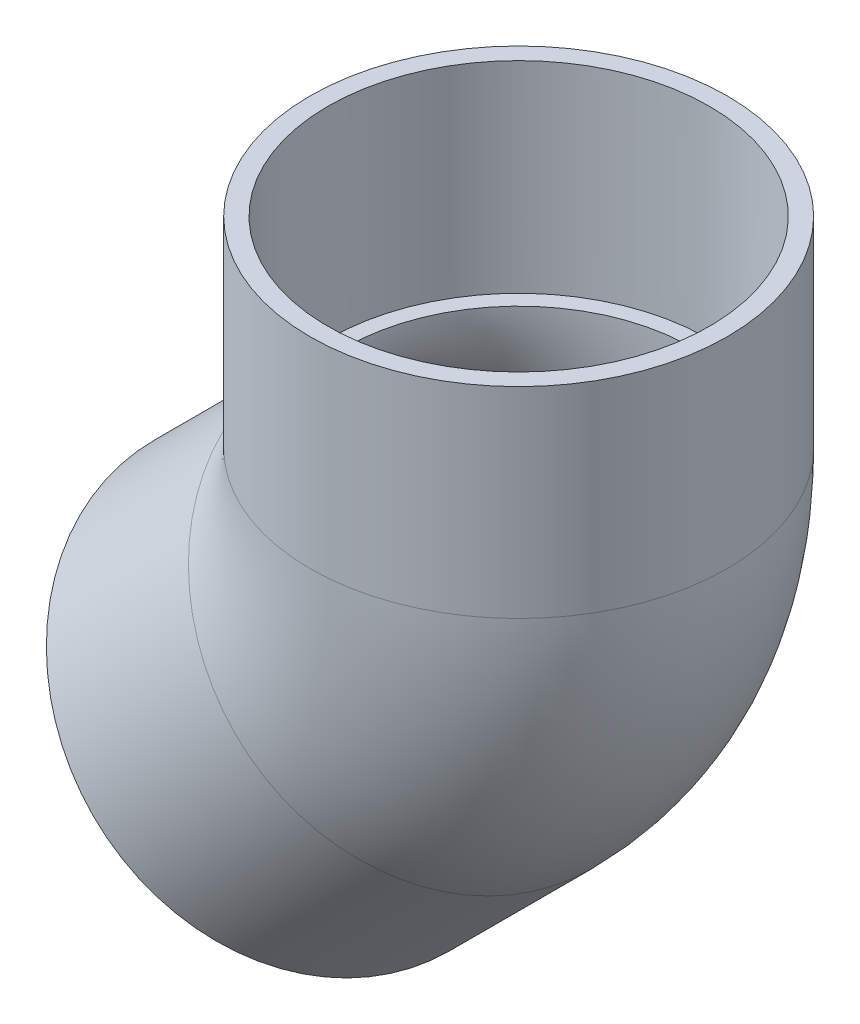
ISO-10303-21;
HEADER;
FILE_DESCRIPTION(('STEP AP214'),'2;1');
FILE_NAME('part.step','',(''),(''),'','','');
FILE_SCHEMA(('AUTOMOTIVE_DESIGN { 1 0 10303 214 1 1 1 1 }'));
ENDSEC;
DATA;
#1=APPLICATION_CONTEXT('core data for automotive mechanical design processes');
#2=APPLICATION_PROTOCOL_DEFINITION('international standard','automotive_design',2000,#1);
#3=PRODUCT_CONTEXT('',#1,'mechanical');
#4=PRODUCT('Part','Part','',(#3));
#5=PRODUCT_RELATED_PRODUCT_CATEGORY('part','',(#4));
#6=PRODUCT_DEFINITION_FORMATION('','',#4);
#7=PRODUCT_DEFINITION_CONTEXT('part definition',#1,'design');
#8=PRODUCT_DEFINITION('design','',#6,#7);
#9=PRODUCT_DEFINITION_SHAPE('','',#8);
#10=(LENGTH_UNIT() NAMED_UNIT(*) SI_UNIT(.MILLI.,.METRE.));
#11=(NAMED_UNIT(*) PLANE_ANGLE_UNIT() SI_UNIT($,.RADIAN.));
#12=(NAMED_UNIT(*) SI_UNIT($,.STERADIAN.) SOLID_ANGLE_UNIT());
#13=UNCERTAINTY_MEASURE_WITH_UNIT(LENGTH_MEASURE(1.E-05),#10,'distance_accuracy_value','');
#14=(GEOMETRIC_REPRESENTATION_CONTEXT(3) GLOBAL_UNCERTAINTY_ASSIGNED_CONTEXT((#13)) GLOBAL_UNIT_ASSIGNED_CONTEXT((#10,
#11,#12)) REPRESENTATION_CONTEXT('',''));
#15=CARTESIAN_POINT('',(0.,0.,0.));
#16=DIRECTION('',(0.,0.,1.));
#17=DIRECTION('',(1.,0.,0.));
#18=AXIS2_PLACEMENT_3D('',#15,#16,#17);
#19=CARTESIAN_POINT('',(-30.6900252937541,-161.262949294099,0.));
#20=DIRECTION('',(-0.707106781186549,-0.707106781186546,0.));
#21=DIRECTION('',(0.707106781186546,-0.707106781186549,0.));
#22=AXIS2_PLACEMENT_3D('',#19,#20,#21);
#23=PLANE('',#22);
#24=CARTESIAN_POINT('',(-95.9764872939267,-95.9764872939264,0.));
#25=DIRECTION('',(-0.707106781186549,-0.707106781186546,0.));
#26=DIRECTION('',(0.707106781186546,-0.707106781186549,0.));
#27=AXIS2_PLACEMENT_3D('',#24,#25,#26);
#28=CIRCLE('',#27,92.3289999999999);
#29=CARTESIAN_POINT('',(-30.6900252937541,-161.262949294099,0.));
#30=VERTEX_POINT('',#29);
#31=EDGE_CURVE('E50',#30,#30,#28,.T.);
#32=ORIENTED_EDGE('',*,*,#31,.T.);
#33=EDGE_LOOP('',(#32));
#34=FACE_BOUND('',#33,.T.);
#35=CARTESIAN_POINT('',(-95.9764872939267,-95.9764872939264,0.));
#36=DIRECTION('',(-0.707106781186549,-0.707106781186546,0.));
#37=DIRECTION('',(0.707106781186546,-0.707106781186549,0.));
#38=AXIS2_PLACEMENT_3D('',#35,#36,#37);
#39=CIRCLE('',#38,84.4168999999999);
#40=CARTESIAN_POINT('',(-36.2847248571802,-155.668249730673,0.));
#41=VERTEX_POINT('',#40);
#42=EDGE_CURVE('E37',#41,#41,#39,.T.);
#43=ORIENTED_EDGE('',*,*,#42,.F.);
#44=EDGE_LOOP('',(#43));
#45=FACE_BOUND('',#44,.T.);
#46=ADVANCED_FACE('F31',(#34,#45),#23,.T.);
#47=CARTESIAN_POINT('',(-33.1146944464425,-33.1146944464424,0.));
#48=DIRECTION('',(-0.707106781186549,-0.707106781186546,0.));
#49=DIRECTION('',(0.707106781186546,-0.707106781186549,0.));
#50=AXIS2_PLACEMENT_3D('',#47,#48,#49);
#51=CONICAL_SURFACE('',#50,83.9977999999999,0.00471425079055353);
#52=ORIENTED_EDGE('',*,*,#42,.T.);
#53=EDGE_LOOP('',(#52));
#54=FACE_BOUND('',#53,.T.);
#55=CARTESIAN_POINT('',(-33.1146944464425,-33.1146944464424,0.));
#56=DIRECTION('',(-0.707106781186549,-0.707106781186546,0.));
#57=DIRECTION('',(0.707106781186546,-0.707106781186549,0.));
#58=AXIS2_PLACEMENT_3D('',#55,#56,#57);
#59=CIRCLE('',#58,83.9977999999999);
#60=CARTESIAN_POINT('',(26.2807195383087,-92.5101084311939,0.));
#61=VERTEX_POINT('',#60);
#62=EDGE_CURVE('E41',#61,#61,#59,.T.);
#63=ORIENTED_EDGE('',*,*,#62,.F.);
#64=EDGE_LOOP('',(#63));
#65=FACE_BOUND('',#64,.T.);
#66=ADVANCED_FACE('F82',(#54,#65),#51,.F.);
#67=CARTESIAN_POINT('',(-95.9764872939267,-95.9764872939264,0.));
#68=DIRECTION('',(-0.707106781186549,-0.707106781186546,0.));
#69=DIRECTION('',(0.707106781186546,-0.707106781186549,0.));
#70=AXIS2_PLACEMENT_3D('',#67,#68,#69);
#71=CYLINDRICAL_SURFACE('',#70,92.329);
#72=CARTESIAN_POINT('',(-33.1146944464426,-33.1146944464425,0.));
#73=DIRECTION('',(-0.707106781186549,-0.707106781186546,0.));
#74=DIRECTION('',(0.707106781186546,-0.707106781186549,0.));
#75=AXIS2_PLACEMENT_3D('',#72,#73,#74);
#76=CIRCLE('',#75,92.329);
#77=CARTESIAN_POINT('',(32.17176755373,-98.4011564466153,0.));
#78=VERTEX_POINT('',#77);
#79=EDGE_CURVE('E45',#78,#78,#76,.T.);
#80=ORIENTED_EDGE('',*,*,#79,.T.);
#81=EDGE_LOOP('',(#80));
#82=FACE_BOUND('',#81,.T.);
#83=ORIENTED_EDGE('',*,*,#31,.F.);
#84=EDGE_LOOP('',(#83));
#85=FACE_BOUND('',#84,.T.);
#86=ADVANCED_FACE('F87',(#82,#85),#71,.T.);
#87=CARTESIAN_POINT('',(-113.060638892885,46.83125,0.));
#88=DIRECTION('',(0.,0.,-1.));
#89=DIRECTION('',(-1.,0.,0.));
#90=AXIS2_PLACEMENT_3D('',#87,#88,#89);
#91=TOROIDAL_SURFACE('',#90,113.060638892885,77.0255);
#92=CARTESIAN_POINT('',(0.,46.83125,0.));
#93=DIRECTION('',(0.,1.,0.));
#94=DIRECTION('',(-1.,0.,0.));
#95=AXIS2_PLACEMENT_3D('',#92,#93,#94);
#96=CIRCLE('',#95,77.0255);
#97=CARTESIAN_POINT('',(77.0255,46.83125,0.));
#98=VERTEX_POINT('',#97);
#99=EDGE_CURVE('E56',#98,#98,#96,.T.);
#100=CARTESIAN_POINT('',(-33.1146944464426,-33.1146944464425,0.));
#101=DIRECTION('',(0.707106781186549,0.707106781186546,0.));
#102=DIRECTION('',(-0.707106781186546,0.707106781186549,0.));
#103=AXIS2_PLACEMENT_3D('',#100,#101,#102);
#104=CIRCLE('',#103,77.0255);
#105=CARTESIAN_POINT('',(21.3505589278418,-87.579947820727,0.));
#106=VERTEX_POINT('',#105);
#107=EDGE_CURVE('E59',#106,#106,#104,.T.);
#108=CARTESIAN_POINT('',(-113.060638892885,46.83125,0.));
#109=DIRECTION('',(0.,0.,-1.));
#110=DIRECTION('',(-1.,0.,0.));
#111=AXIS2_PLACEMENT_3D('',#108,#109,#110);
#112=CIRCLE('',#111,190.086138892885);
#113=EDGE_CURVE('',#98,#106,#112,.T.);
#114=ORIENTED_EDGE('',*,*,#99,.T.);
#115=ORIENTED_EDGE('',*,*,#107,.F.);
#116=ORIENTED_EDGE('',*,*,#113,.T.);
#117=ORIENTED_EDGE('',*,*,#113,.F.);
#118=EDGE_LOOP('',(#114,#116,#115,#117));
#119=FACE_BOUND('',#118,.T.);
#120=ADVANCED_FACE('F92',(#119),#91,.F.);
#121=CARTESIAN_POINT('',(-113.060638892885,46.83125,0.));
#122=DIRECTION('',(0.,0.,-1.));
#123=DIRECTION('',(-1.,0.,0.));
#124=AXIS2_PLACEMENT_3D('',#121,#122,#123);
#125=TOROIDAL_SURFACE('',#124,113.060638892885,92.329);
#126=CARTESIAN_POINT('',(0.,46.83125,0.));
#127=DIRECTION('',(0.,1.,0.));
#128=DIRECTION('',(-1.,0.,0.));
#129=AXIS2_PLACEMENT_3D('',#126,#127,#128);
#130=CIRCLE('',#129,92.329);
#131=CARTESIAN_POINT('',(92.329,46.83125,0.));
#132=VERTEX_POINT('',#131);
#133=EDGE_CURVE('E53',#132,#132,#130,.T.);
#134=CARTESIAN_POINT('',(-113.060638892885,46.83125,0.));
#135=DIRECTION('',(0.,0.,-1.));
#136=DIRECTION('',(-1.,0.,0.));
#137=AXIS2_PLACEMENT_3D('',#134,#135,#136);
#138=CIRCLE('',#137,205.389638892885);
#139=EDGE_CURVE('',#132,#78,#138,.T.);
#140=ORIENTED_EDGE('',*,*,#133,.F.);
#141=ORIENTED_EDGE('',*,*,#79,.F.);
#142=ORIENTED_EDGE('',*,*,#139,.T.);
#143=ORIENTED_EDGE('',*,*,#139,.F.);
#144=EDGE_LOOP('',(#140,#142,#141,#143));
#145=FACE_BOUND('',#144,.T.);
#146=ADVANCED_FACE('F98',(#145),#125,.T.);
#147=CARTESIAN_POINT('',(0.,46.83125,0.));
#148=DIRECTION('',(0.,1.,0.));
#149=DIRECTION('',(-1.,0.,0.));
#150=AXIS2_PLACEMENT_3D('',#147,#148,#149);
#151=PLANE('',#150);
#152=CARTESIAN_POINT('',(0.,46.83125,0.));
#153=DIRECTION('',(0.,1.,0.));
#154=DIRECTION('',(-1.,0.,0.));
#155=AXIS2_PLACEMENT_3D('',#152,#153,#154);
#156=CIRCLE('',#155,83.9978);
#157=CARTESIAN_POINT('',(-83.9977999999999,46.83125,0.));
#158=VERTEX_POINT('',#157);
#159=EDGE_CURVE('E10',#158,#158,#156,.F.);
#160=ORIENTED_EDGE('',*,*,#159,.F.);
#161=EDGE_LOOP('',(#160));
#162=FACE_BOUND('',#161,.T.);
#163=ORIENTED_EDGE('',*,*,#99,.F.);
#164=EDGE_LOOP('',(#163));
#165=FACE_BOUND('',#164,.T.);
#166=ADVANCED_FACE('F103',(#162,#165),#151,.T.);
#167=CARTESIAN_POINT('',(-33.1146944464426,-33.1146944464425,0.));
#168=DIRECTION('',(0.707106781186549,0.707106781186546,0.));
#169=DIRECTION('',(-0.707106781186546,0.707106781186549,0.));
#170=AXIS2_PLACEMENT_3D('',#167,#168,#169);
#171=PLANE('',#170);
#172=ORIENTED_EDGE('',*,*,#62,.T.);
#173=EDGE_LOOP('',(#172));
#174=FACE_BOUND('',#173,.T.);
#175=ORIENTED_EDGE('',*,*,#107,.T.);
#176=EDGE_LOOP('',(#175));
#177=FACE_BOUND('',#176,.T.);
#178=ADVANCED_FACE('F108',(#174,#177),#171,.F.);
#179=CARTESIAN_POINT('',(92.329,135.73125,0.));
#180=DIRECTION('',(0.,1.,0.));
#181=DIRECTION('',(0.,0.,1.));
#182=AXIS2_PLACEMENT_3D('',#179,#180,#181);
#183=PLANE('',#182);
#184=CARTESIAN_POINT('',(0.,135.73125,0.));
#185=DIRECTION('',(0.,-1.,0.));
#186=DIRECTION('',(0.,0.,-1.));
#187=AXIS2_PLACEMENT_3D('',#184,#185,#186);
#188=CIRCLE('',#187,84.4169);
#189=CARTESIAN_POINT('',(0.,135.73125,-84.4169));
#190=VERTEX_POINT('',#189);
#191=EDGE_CURVE('E65',#190,#190,#188,.T.);
#192=ORIENTED_EDGE('',*,*,#191,.T.);
#193=EDGE_LOOP('',(#192));
#194=FACE_BOUND('',#193,.T.);
#195=CARTESIAN_POINT('',(0.,135.73125,0.));
#196=DIRECTION('',(0.,-1.,0.));
#197=DIRECTION('',(0.,0.,-1.));
#198=AXIS2_PLACEMENT_3D('',#195,#196,#197);
#199=CIRCLE('',#198,92.329);
#200=CARTESIAN_POINT('',(0.,135.73125,-92.329));
#201=VERTEX_POINT('',#200);
#202=EDGE_CURVE('E62',#201,#201,#199,.T.);
#203=ORIENTED_EDGE('',*,*,#202,.F.);
#204=EDGE_LOOP('',(#203));
#205=FACE_BOUND('',#204,.T.);
#206=ADVANCED_FACE('F69',(#194,#205),#183,.T.);
#207=CARTESIAN_POINT('',(0.,0.,0.));
#208=DIRECTION('',(0.,-1.,0.));
#209=DIRECTION('',(0.,0.,-1.));
#210=AXIS2_PLACEMENT_3D('',#207,#208,#209);
#211=CYLINDRICAL_SURFACE('',#210,92.329);
#212=ORIENTED_EDGE('',*,*,#202,.T.);
#213=EDGE_LOOP('',(#212));
#214=FACE_BOUND('',#213,.T.);
#215=ORIENTED_EDGE('',*,*,#133,.T.);
#216=EDGE_LOOP('',(#215));
#217=FACE_BOUND('',#216,.T.);
#218=ADVANCED_FACE('F74',(#214,#217),#211,.T.);
#219=CARTESIAN_POINT('',(0.,135.73125,0.));
#220=DIRECTION('',(0.,1.,0.));
#221=DIRECTION('',(0.,0.,1.));
#222=AXIS2_PLACEMENT_3D('',#219,#220,#221);
#223=CONICAL_SURFACE('',#222,84.4169,0.00471425079055338);
#224=ORIENTED_EDGE('',*,*,#159,.T.);
#225=EDGE_LOOP('',(#224));
#226=FACE_BOUND('',#225,.T.);
#227=ORIENTED_EDGE('',*,*,#191,.F.);
#228=EDGE_LOOP('',(#227));
#229=FACE_BOUND('',#228,.T.);
#230=ADVANCED_FACE('F72',(#226,#229),#223,.F.);
#231=CLOSED_SHELL('',(#46,#66,#86,#120,#146,#166,#178,#206,#218,#230));
#232=MANIFOLD_SOLID_BREP('B2',#231);
#233=ADVANCED_BREP_SHAPE_REPRESENTATION('',(#18,#232),#14);
#234=SHAPE_DEFINITION_REPRESENTATION(#9,#233);
ENDSEC;
END-ISO-10303-21;
